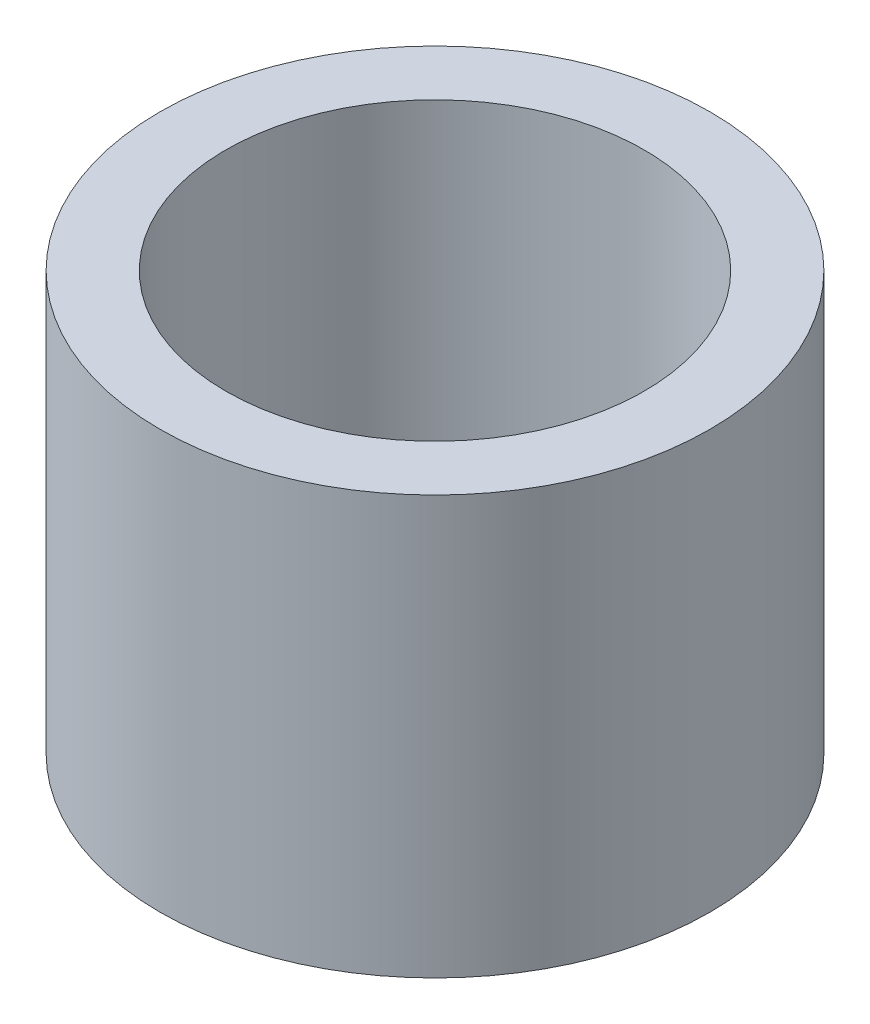
ISO-10303-21;
HEADER;
FILE_DESCRIPTION(('STEP AP214'),'2;1');
FILE_NAME('part.step','',(''),(''),'','','');
FILE_SCHEMA(('AUTOMOTIVE_DESIGN { 1 0 10303 214 1 1 1 1 }'));
ENDSEC;
DATA;
#1=APPLICATION_CONTEXT('core data for automotive mechanical design processes');
#2=APPLICATION_PROTOCOL_DEFINITION('international standard','automotive_design',2000,#1);
#3=PRODUCT_CONTEXT('',#1,'mechanical');
#4=PRODUCT('Part','Part','',(#3));
#5=PRODUCT_RELATED_PRODUCT_CATEGORY('part','',(#4));
#6=PRODUCT_DEFINITION_FORMATION('','',#4);
#7=PRODUCT_DEFINITION_CONTEXT('part definition',#1,'design');
#8=PRODUCT_DEFINITION('design','',#6,#7);
#9=PRODUCT_DEFINITION_SHAPE('','',#8);
#10=(LENGTH_UNIT() NAMED_UNIT(*) SI_UNIT(.MILLI.,.METRE.));
#11=(NAMED_UNIT(*) PLANE_ANGLE_UNIT() SI_UNIT($,.RADIAN.));
#12=(NAMED_UNIT(*) SI_UNIT($,.STERADIAN.) SOLID_ANGLE_UNIT());
#13=UNCERTAINTY_MEASURE_WITH_UNIT(LENGTH_MEASURE(1.E-05),#10,'distance_accuracy_value','');
#14=(GEOMETRIC_REPRESENTATION_CONTEXT(3) GLOBAL_UNCERTAINTY_ASSIGNED_CONTEXT((#13)) GLOBAL_UNIT_ASSIGNED_CONTEXT((#10,
#11,#12)) REPRESENTATION_CONTEXT('',''));
#15=CARTESIAN_POINT('',(0.,0.,0.));
#16=DIRECTION('',(0.,0.,1.));
#17=DIRECTION('',(1.,0.,0.));
#18=AXIS2_PLACEMENT_3D('',#15,#16,#17);
#19=CARTESIAN_POINT('',(0.,72.6361471968237,0.));
#20=DIRECTION('',(0.,-1.,0.));
#21=DIRECTION('',(0.,0.,-1.));
#22=AXIS2_PLACEMENT_3D('',#19,#20,#21);
#23=CYLINDRICAL_SURFACE('',#22,16.7005);
#24=CARTESIAN_POINT('',(0.,0.,0.));
#25=DIRECTION('',(0.,1.,0.));
#26=DIRECTION('',(0.,0.,1.));
#27=AXIS2_PLACEMENT_3D('',#24,#25,#26);
#28=CIRCLE('',#27,16.7005);
#29=CARTESIAN_POINT('',(0.,0.,16.7005));
#30=VERTEX_POINT('',#29);
#31=EDGE_CURVE('E42',#30,#30,#28,.T.);
#32=ORIENTED_EDGE('',*,*,#31,.T.);
#33=EDGE_LOOP('',(#32));
#34=FACE_BOUND('',#33,.T.);
#35=CARTESIAN_POINT('',(0.,25.3999999999999,0.));
#36=DIRECTION('',(0.,1.,0.));
#37=DIRECTION('',(0.,0.,1.));
#38=AXIS2_PLACEMENT_3D('',#35,#36,#37);
#39=CIRCLE('',#38,16.7005);
#40=CARTESIAN_POINT('',(0.,25.3999999999999,16.7005));
#41=VERTEX_POINT('',#40);
#42=EDGE_CURVE('E10',#41,#41,#39,.T.);
#43=ORIENTED_EDGE('',*,*,#42,.F.);
#44=EDGE_LOOP('',(#43));
#45=FACE_BOUND('',#44,.T.);
#46=ADVANCED_FACE('F35',(#34,#45),#23,.T.);
#47=CARTESIAN_POINT('',(0.,0.,0.));
#48=DIRECTION('',(0.,1.,0.));
#49=DIRECTION('',(0.,0.,1.));
#50=AXIS2_PLACEMENT_3D('',#47,#48,#49);
#51=PLANE('',#50);
#52=ORIENTED_EDGE('',*,*,#31,.F.);
#53=EDGE_LOOP('',(#52));
#54=FACE_BOUND('',#53,.T.);
#55=CARTESIAN_POINT('',(0.,0.,0.));
#56=DIRECTION('',(0.,1.,0.));
#57=DIRECTION('',(0.,0.,1.));
#58=AXIS2_PLACEMENT_3D('',#55,#56,#57);
#59=CIRCLE('',#58,12.7);
#60=CARTESIAN_POINT('',(0.,0.,12.7));
#61=VERTEX_POINT('',#60);
#62=EDGE_CURVE('E47',#61,#61,#59,.T.);
#63=ORIENTED_EDGE('',*,*,#62,.T.);
#64=EDGE_LOOP('',(#63));
#65=FACE_BOUND('',#64,.T.);
#66=ADVANCED_FACE('F63',(#54,#65),#51,.F.);
#67=CARTESIAN_POINT('',(0.,72.6361471968237,0.));
#68=DIRECTION('',(0.,-1.,0.));
#69=DIRECTION('',(0.,0.,-1.));
#70=AXIS2_PLACEMENT_3D('',#67,#68,#69);
#71=CYLINDRICAL_SURFACE('',#70,12.7);
#72=ORIENTED_EDGE('',*,*,#62,.F.);
#73=EDGE_LOOP('',(#72));
#74=FACE_BOUND('',#73,.T.);
#75=CARTESIAN_POINT('',(0.,25.3999999999999,0.));
#76=DIRECTION('',(0.,1.,0.));
#77=DIRECTION('',(0.,0.,1.));
#78=AXIS2_PLACEMENT_3D('',#75,#76,#77);
#79=CIRCLE('',#78,12.7);
#80=CARTESIAN_POINT('',(0.,25.3999999999999,12.7));
#81=VERTEX_POINT('',#80);
#82=EDGE_CURVE('E38',#81,#81,#79,.T.);
#83=ORIENTED_EDGE('',*,*,#82,.T.);
#84=EDGE_LOOP('',(#83));
#85=FACE_BOUND('',#84,.T.);
#86=ADVANCED_FACE('F55',(#74,#85),#71,.F.);
#87=CARTESIAN_POINT('',(0.,25.3999999999999,-13.3350000000001));
#88=DIRECTION('',(0.,1.,0.));
#89=DIRECTION('',(1.,0.,0.));
#90=AXIS2_PLACEMENT_3D('',#87,#88,#89);
#91=PLANE('',#90);
#92=ORIENTED_EDGE('',*,*,#82,.F.);
#93=EDGE_LOOP('',(#92));
#94=FACE_BOUND('',#93,.T.);
#95=ORIENTED_EDGE('',*,*,#42,.T.);
#96=EDGE_LOOP('',(#95));
#97=FACE_BOUND('',#96,.T.);
#98=ADVANCED_FACE('F57',(#94,#97),#91,.T.);
#99=CLOSED_SHELL('',(#46,#66,#86,#98));
#100=MANIFOLD_SOLID_BREP('B2',#99);
#101=ADVANCED_BREP_SHAPE_REPRESENTATION('',(#18,#100),#14);
#102=SHAPE_DEFINITION_REPRESENTATION(#9,#101);
ENDSEC;
END-ISO-10303-21;
